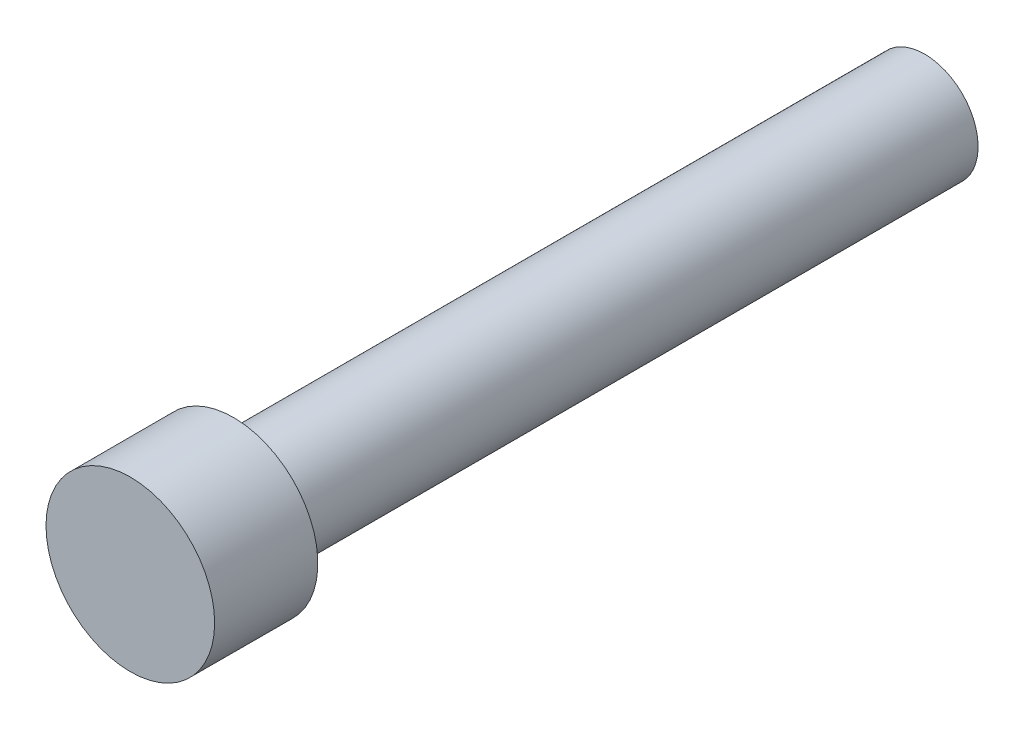
ISO-10303-21;
HEADER;
FILE_DESCRIPTION(('STEP AP214'),'2;1');
FILE_NAME('part.step','',(''),(''),'','','');
FILE_SCHEMA(('AUTOMOTIVE_DESIGN { 1 0 10303 214 1 1 1 1 }'));
ENDSEC;
DATA;
#1=APPLICATION_CONTEXT('core data for automotive mechanical design processes');
#2=APPLICATION_PROTOCOL_DEFINITION('international standard','automotive_design',2000,#1);
#3=PRODUCT_CONTEXT('',#1,'mechanical');
#4=PRODUCT('Part','Part','',(#3));
#5=PRODUCT_RELATED_PRODUCT_CATEGORY('part','',(#4));
#6=PRODUCT_DEFINITION_FORMATION('','',#4);
#7=PRODUCT_DEFINITION_CONTEXT('part definition',#1,'design');
#8=PRODUCT_DEFINITION('design','',#6,#7);
#9=PRODUCT_DEFINITION_SHAPE('','',#8);
#10=(LENGTH_UNIT() NAMED_UNIT(*) SI_UNIT(.MILLI.,.METRE.));
#11=(NAMED_UNIT(*) PLANE_ANGLE_UNIT() SI_UNIT($,.RADIAN.));
#12=(NAMED_UNIT(*) SI_UNIT($,.STERADIAN.) SOLID_ANGLE_UNIT());
#13=UNCERTAINTY_MEASURE_WITH_UNIT(LENGTH_MEASURE(1.E-05),#10,'distance_accuracy_value','');
#14=(GEOMETRIC_REPRESENTATION_CONTEXT(3) GLOBAL_UNCERTAINTY_ASSIGNED_CONTEXT((#13)) GLOBAL_UNIT_ASSIGNED_CONTEXT((#10,
#11,#12)) REPRESENTATION_CONTEXT('',''));
#15=CARTESIAN_POINT('',(0.,0.,0.));
#16=DIRECTION('',(0.,0.,1.));
#17=DIRECTION('',(1.,0.,0.));
#18=AXIS2_PLACEMENT_3D('',#15,#16,#17);
#19=CARTESIAN_POINT('',(0.,0.,21.8948));
#20=DIRECTION('',(0.,0.,-1.));
#21=DIRECTION('',(-1.,0.,0.));
#22=AXIS2_PLACEMENT_3D('',#19,#20,#21);
#23=CYLINDRICAL_SURFACE('',#22,2.3241);
#24=CARTESIAN_POINT('',(0.,0.,21.8948));
#25=DIRECTION('',(0.,0.,1.));
#26=DIRECTION('',(1.,0.,0.));
#27=AXIS2_PLACEMENT_3D('',#24,#25,#26);
#28=CIRCLE('',#27,2.3241);
#29=CARTESIAN_POINT('',(2.3241,0.,21.8948));
#30=VERTEX_POINT('',#29);
#31=EDGE_CURVE('E11',#30,#30,#28,.T.);
#32=ORIENTED_EDGE('',*,*,#31,.F.);
#33=EDGE_LOOP('',(#32));
#34=FACE_BOUND('',#33,.T.);
#35=CARTESIAN_POINT('',(0.,0.,19.05));
#36=DIRECTION('',(0.,0.,-1.));
#37=DIRECTION('',(-1.,0.,0.));
#38=AXIS2_PLACEMENT_3D('',#35,#36,#37);
#39=CIRCLE('',#38,2.3241);
#40=CARTESIAN_POINT('',(-2.3241,0.,19.05));
#41=VERTEX_POINT('',#40);
#42=EDGE_CURVE('E33',#41,#41,#39,.T.);
#43=ORIENTED_EDGE('',*,*,#42,.F.);
#44=EDGE_LOOP('',(#43));
#45=FACE_BOUND('',#44,.T.);
#46=ADVANCED_FACE('F30',(#34,#45),#23,.T.);
#47=CARTESIAN_POINT('',(0.,0.,21.8948));
#48=DIRECTION('',(0.,0.,1.));
#49=DIRECTION('',(1.,0.,0.));
#50=AXIS2_PLACEMENT_3D('',#47,#48,#49);
#51=PLANE('',#50);
#52=ORIENTED_EDGE('',*,*,#31,.T.);
#53=EDGE_LOOP('',(#52));
#54=FACE_BOUND('',#53,.T.);
#55=ADVANCED_FACE('F54',(#54),#51,.T.);
#56=CARTESIAN_POINT('',(0.,0.,19.05));
#57=DIRECTION('',(0.,0.,-1.));
#58=DIRECTION('',(-1.,0.,0.));
#59=AXIS2_PLACEMENT_3D('',#56,#57,#58);
#60=PLANE('',#59);
#61=CARTESIAN_POINT('',(0.,0.,19.05));
#62=DIRECTION('',(0.,0.,-1.));
#63=DIRECTION('',(-1.,0.,0.));
#64=AXIS2_PLACEMENT_3D('',#61,#62,#63);
#65=CIRCLE('',#64,1.4732);
#66=CARTESIAN_POINT('',(-1.4732,0.,19.05));
#67=VERTEX_POINT('',#66);
#68=EDGE_CURVE('E40',#67,#67,#65,.T.);
#69=ORIENTED_EDGE('',*,*,#68,.F.);
#70=EDGE_LOOP('',(#69));
#71=FACE_BOUND('',#70,.T.);
#72=ORIENTED_EDGE('',*,*,#42,.T.);
#73=EDGE_LOOP('',(#72));
#74=FACE_BOUND('',#73,.T.);
#75=ADVANCED_FACE('F51',(#71,#74),#60,.T.);
#76=CARTESIAN_POINT('',(0.,0.,19.05));
#77=DIRECTION('',(0.,0.,-1.));
#78=DIRECTION('',(-1.,0.,0.));
#79=AXIS2_PLACEMENT_3D('',#76,#77,#78);
#80=CYLINDRICAL_SURFACE('',#79,1.4732);
#81=ORIENTED_EDGE('',*,*,#68,.T.);
#82=EDGE_LOOP('',(#81));
#83=FACE_BOUND('',#82,.T.);
#84=CARTESIAN_POINT('',(0.,0.,0.));
#85=DIRECTION('',(0.,0.,-1.));
#86=DIRECTION('',(-1.,0.,0.));
#87=AXIS2_PLACEMENT_3D('',#84,#85,#86);
#88=CIRCLE('',#87,1.4732);
#89=CARTESIAN_POINT('',(-1.4732,0.,0.));
#90=VERTEX_POINT('',#89);
#91=EDGE_CURVE('E42',#90,#90,#88,.T.);
#92=ORIENTED_EDGE('',*,*,#91,.F.);
#93=EDGE_LOOP('',(#92));
#94=FACE_BOUND('',#93,.T.);
#95=ADVANCED_FACE('F48',(#83,#94),#80,.T.);
#96=CARTESIAN_POINT('',(0.,0.,0.));
#97=DIRECTION('',(0.,0.,1.));
#98=DIRECTION('',(1.,0.,0.));
#99=AXIS2_PLACEMENT_3D('',#96,#97,#98);
#100=PLANE('',#99);
#101=ORIENTED_EDGE('',*,*,#91,.T.);
#102=EDGE_LOOP('',(#101));
#103=FACE_BOUND('',#102,.T.);
#104=ADVANCED_FACE('F67',(#103),#100,.F.);
#105=CLOSED_SHELL('',(#46,#55,#75,#95,#104));
#106=MANIFOLD_SOLID_BREP('B2',#105);
#107=ADVANCED_BREP_SHAPE_REPRESENTATION('',(#18,#106),#14);
#108=SHAPE_DEFINITION_REPRESENTATION(#9,#107);
ENDSEC;
END-ISO-10303-21;
